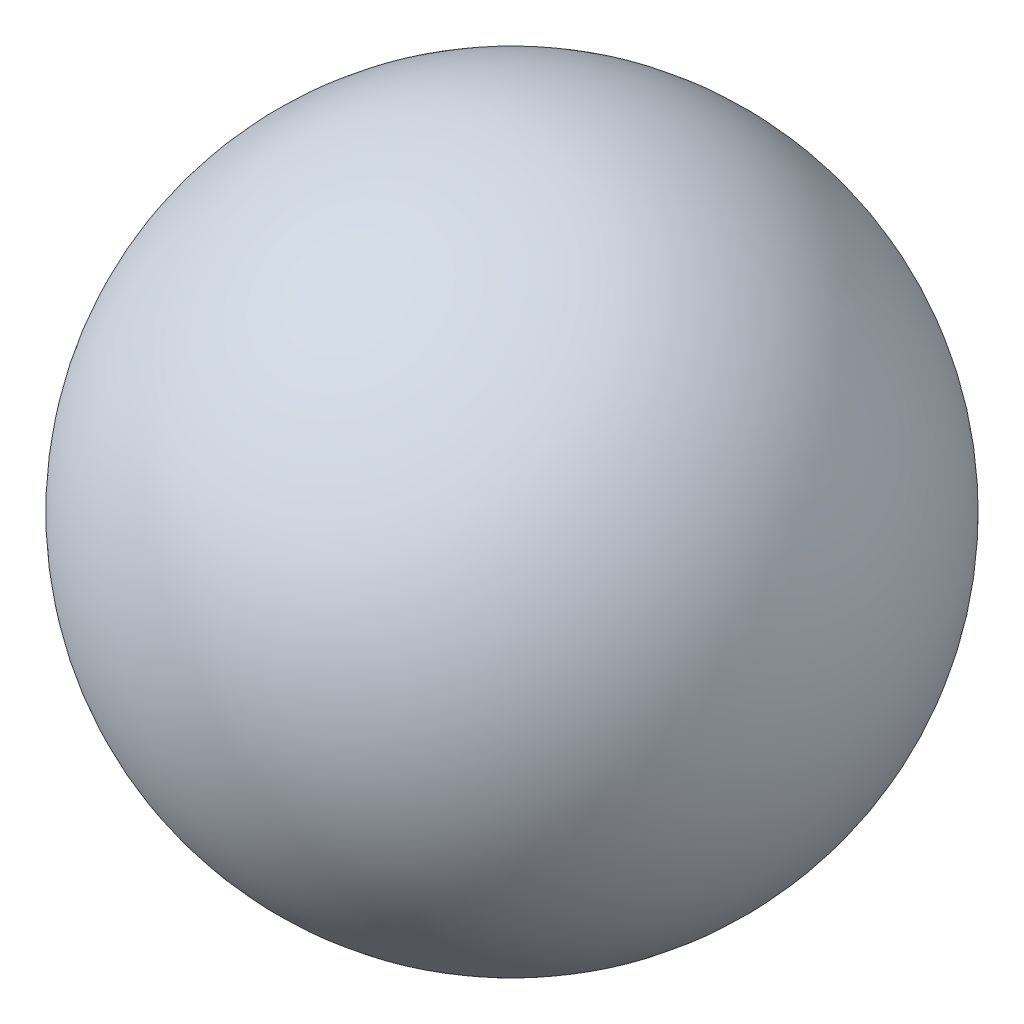
ISO-10303-21;
HEADER;
FILE_DESCRIPTION(('STEP AP214'),'2;1');
FILE_NAME('part.step','',(''),(''),'','','');
FILE_SCHEMA(('AUTOMOTIVE_DESIGN { 1 0 10303 214 1 1 1 1 }'));
ENDSEC;
DATA;
#1=APPLICATION_CONTEXT('core data for automotive mechanical design processes');
#2=APPLICATION_PROTOCOL_DEFINITION('international standard','automotive_design',2000,#1);
#3=PRODUCT_CONTEXT('',#1,'mechanical');
#4=PRODUCT('Part','Part','',(#3));
#5=PRODUCT_RELATED_PRODUCT_CATEGORY('part','',(#4));
#6=PRODUCT_DEFINITION_FORMATION('','',#4);
#7=PRODUCT_DEFINITION_CONTEXT('part definition',#1,'design');
#8=PRODUCT_DEFINITION('design','',#6,#7);
#9=PRODUCT_DEFINITION_SHAPE('','',#8);
#10=(LENGTH_UNIT() NAMED_UNIT(*) SI_UNIT(.MILLI.,.METRE.));
#11=(NAMED_UNIT(*) PLANE_ANGLE_UNIT() SI_UNIT($,.RADIAN.));
#12=(NAMED_UNIT(*) SI_UNIT($,.STERADIAN.) SOLID_ANGLE_UNIT());
#13=UNCERTAINTY_MEASURE_WITH_UNIT(LENGTH_MEASURE(1.E-05),#10,'distance_accuracy_value','');
#14=(GEOMETRIC_REPRESENTATION_CONTEXT(3) GLOBAL_UNCERTAINTY_ASSIGNED_CONTEXT((#13)) GLOBAL_UNIT_ASSIGNED_CONTEXT((#10,
#11,#12)) REPRESENTATION_CONTEXT('',''));
#15=CARTESIAN_POINT('',(0.,0.,0.));
#16=DIRECTION('',(0.,0.,1.));
#17=DIRECTION('',(1.,0.,0.));
#18=AXIS2_PLACEMENT_3D('',#15,#16,#17);
#19=CARTESIAN_POINT('',(0.,8.50000000000018,0.));
#20=DIRECTION('',(0.,-1.00000000000002,0.));
#21=DIRECTION('',(1.,0.,0.));
#22=AXIS2_PLACEMENT_3D('',#19,#20,#21);
#23=SPHERICAL_SURFACE('',#22,2.5);
#24=CARTESIAN_POINT('',(0.,6.00000000000013,0.));
#25=VERTEX_POINT('',#24);
#26=VERTEX_LOOP('',#25);
#27=FACE_BOUND('',#26,.T.);
#28=ADVANCED_FACE('F26',(#27),#23,.T.);
#29=CLOSED_SHELL('',(#28));
#30=MANIFOLD_SOLID_BREP('B2',#29);
#31=ADVANCED_BREP_SHAPE_REPRESENTATION('',(#18,#30),#14);
#32=SHAPE_DEFINITION_REPRESENTATION(#9,#31);
ENDSEC;
END-ISO-10303-21;
